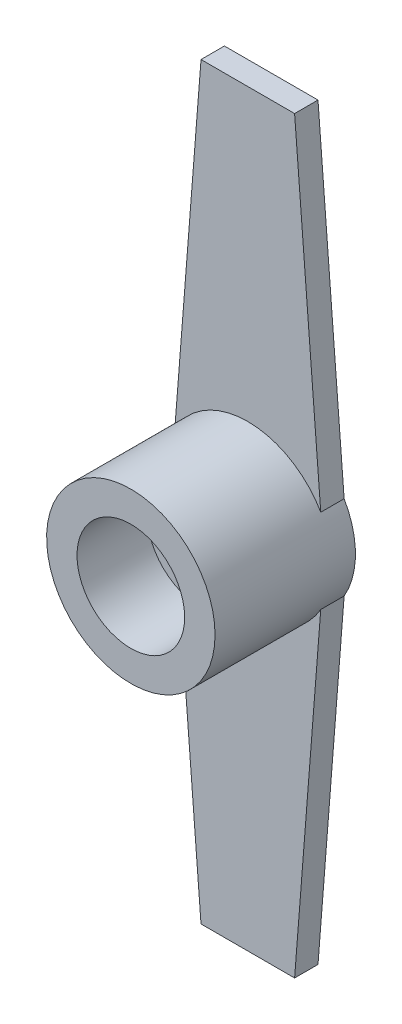
ISO-10303-21;
HEADER;
FILE_DESCRIPTION(('STEP AP214'),'2;1');
FILE_NAME('part.step','',(''),(''),'','','');
FILE_SCHEMA(('AUTOMOTIVE_DESIGN { 1 0 10303 214 1 1 1 1 }'));
ENDSEC;
DATA;
#1=APPLICATION_CONTEXT('core data for automotive mechanical design processes');
#2=APPLICATION_PROTOCOL_DEFINITION('international standard','automotive_design',2000,#1);
#3=PRODUCT_CONTEXT('',#1,'mechanical');
#4=PRODUCT('Part','Part','',(#3));
#5=PRODUCT_RELATED_PRODUCT_CATEGORY('part','',(#4));
#6=PRODUCT_DEFINITION_FORMATION('','',#4);
#7=PRODUCT_DEFINITION_CONTEXT('part definition',#1,'design');
#8=PRODUCT_DEFINITION('design','',#6,#7);
#9=PRODUCT_DEFINITION_SHAPE('','',#8);
#10=(LENGTH_UNIT() NAMED_UNIT(*) SI_UNIT(.MILLI.,.METRE.));
#11=(NAMED_UNIT(*) PLANE_ANGLE_UNIT() SI_UNIT($,.RADIAN.));
#12=(NAMED_UNIT(*) SI_UNIT($,.STERADIAN.) SOLID_ANGLE_UNIT());
#13=UNCERTAINTY_MEASURE_WITH_UNIT(LENGTH_MEASURE(1.E-05),#10,'distance_accuracy_value','');
#14=(GEOMETRIC_REPRESENTATION_CONTEXT(3) GLOBAL_UNCERTAINTY_ASSIGNED_CONTEXT((#13)) GLOBAL_UNIT_ASSIGNED_CONTEXT((#10,
#11,#12)) REPRESENTATION_CONTEXT('',''));
#15=CARTESIAN_POINT('',(0.,0.,0.));
#16=DIRECTION('',(0.,0.,1.));
#17=DIRECTION('',(1.,0.,0.));
#18=AXIS2_PLACEMENT_3D('',#15,#16,#17);
#19=CARTESIAN_POINT('',(-1.59594559789866E-13,0.,1.));
#20=DIRECTION('',(0.,0.,1.));
#21=DIRECTION('',(1.,0.,0.));
#22=AXIS2_PLACEMENT_3D('',#19,#20,#21);
#23=PLANE('',#22);
#24=CARTESIAN_POINT('',(0.,0.,1.));
#25=DIRECTION('',(0.,0.,1.));
#26=DIRECTION('',(1.,0.,0.));
#27=AXIS2_PLACEMENT_3D('',#24,#25,#26);
#28=CIRCLE('',#27,3.59999999999998);
#29=CARTESIAN_POINT('',(3.11769145362396,1.79999999999999,1.));
#30=VERTEX_POINT('',#29);
#31=CARTESIAN_POINT('',(-3.117691453624,1.80000000000001,1.));
#32=VERTEX_POINT('',#31);
#33=EDGE_CURVE('E49',#30,#32,#28,.T.);
#34=ORIENTED_EDGE('',*,*,#33,.F.);
#35=DIRECTION('',(-0.0784679720450922,0.996916635112049,0.));
#36=VECTOR('',#35,1.);
#37=CARTESIAN_POINT('',(3.11769145362398,1.8,1.));
#38=LINE('',#37,#36);
#39=CARTESIAN_POINT('',(2.,16.,1.));
#40=VERTEX_POINT('',#39);
#41=EDGE_CURVE('E177',#30,#40,#38,.T.);
#42=ORIENTED_EDGE('',*,*,#41,.T.);
#43=DIRECTION('',(-1.,0.,0.));
#44=VECTOR('',#43,1.);
#45=CARTESIAN_POINT('',(-2.,16.,1.));
#46=LINE('',#45,#44);
#47=CARTESIAN_POINT('',(-2.,16.,1.));
#48=VERTEX_POINT('',#47);
#49=EDGE_CURVE('E130',#40,#48,#46,.T.);
#50=ORIENTED_EDGE('',*,*,#49,.T.);
#51=DIRECTION('',(-0.0784679720450919,-0.996916635112049,0.));
#52=VECTOR('',#51,1.);
#53=CARTESIAN_POINT('',(-3.11769145362398,1.8,1.));
#54=LINE('',#53,#52);
#55=EDGE_CURVE('E126',#48,#32,#54,.T.);
#56=ORIENTED_EDGE('',*,*,#55,.T.);
#57=EDGE_LOOP('',(#34,#42,#50,#56));
#58=FACE_BOUND('',#57,.T.);
#59=ADVANCED_FACE('F38',(#58),#23,.T.);
#60=CARTESIAN_POINT('',(3.11769145362398,-1.8,1.));
#61=DIRECTION('',(-0.996916635112049,0.0784679720450922,0.));
#62=DIRECTION('',(-0.0784679720450922,-0.996916635112049,0.));
#63=AXIS2_PLACEMENT_3D('',#60,#61,#62);
#64=PLANE('',#63);
#65=DIRECTION('',(0.0784679720450922,0.996916635112049,0.));
#66=VECTOR('',#65,1.);
#67=CARTESIAN_POINT('',(3.11769145362398,-1.8,0.));
#68=LINE('',#67,#66);
#69=CARTESIAN_POINT('',(2.,-16.,0.));
#70=VERTEX_POINT('',#69);
#71=CARTESIAN_POINT('',(3.11769145362396,-1.79999999999999,0.));
#72=VERTEX_POINT('',#71);
#73=EDGE_CURVE('E134',#70,#72,#68,.T.);
#74=ORIENTED_EDGE('',*,*,#73,.T.);
#75=DIRECTION('',(0.,0.,-1.));
#76=VECTOR('',#75,1.);
#77=CARTESIAN_POINT('',(3.11769145362396,-1.79999999999999,1.));
#78=LINE('',#77,#76);
#79=CARTESIAN_POINT('',(3.11769145362396,-1.79999999999999,1.));
#80=VERTEX_POINT('',#79);
#81=EDGE_CURVE('E42',#80,#72,#78,.T.);
#82=ORIENTED_EDGE('',*,*,#81,.F.);
#83=DIRECTION('',(0.0784679720450922,0.996916635112049,0.));
#84=VECTOR('',#83,1.);
#85=CARTESIAN_POINT('',(3.11769145362398,-1.8,1.));
#86=LINE('',#85,#84);
#87=CARTESIAN_POINT('',(2.,-16.,1.));
#88=VERTEX_POINT('',#87);
#89=EDGE_CURVE('E99',#88,#80,#86,.T.);
#90=ORIENTED_EDGE('',*,*,#89,.F.);
#91=DIRECTION('',(0.,0.,-1.));
#92=VECTOR('',#91,1.);
#93=CARTESIAN_POINT('',(2.,-16.,1.));
#94=LINE('',#93,#92);
#95=EDGE_CURVE('E128',#88,#70,#94,.T.);
#96=ORIENTED_EDGE('',*,*,#95,.T.);
#97=EDGE_LOOP('',(#74,#82,#90,#96));
#98=FACE_BOUND('',#97,.T.);
#99=ADVANCED_FACE('F40',(#98),#64,.F.);
#100=CARTESIAN_POINT('',(3.11769145362398,1.8,1.));
#101=DIRECTION('',(-0.996916635112049,-0.0784679720450922,0.));
#102=DIRECTION('',(0.0784679720450922,-0.996916635112049,0.));
#103=AXIS2_PLACEMENT_3D('',#100,#101,#102);
#104=PLANE('',#103);
#105=DIRECTION('',(-0.0784679720450922,0.996916635112049,0.));
#106=VECTOR('',#105,1.);
#107=CARTESIAN_POINT('',(3.11769145362398,1.8,0.));
#108=LINE('',#107,#106);
#109=CARTESIAN_POINT('',(3.11769145362398,1.8,0.));
#110=VERTEX_POINT('',#109);
#111=CARTESIAN_POINT('',(2.,16.,0.));
#112=VERTEX_POINT('',#111);
#113=EDGE_CURVE('E140',#110,#112,#108,.T.);
#114=ORIENTED_EDGE('',*,*,#113,.T.);
#115=DIRECTION('',(0.,0.,-1.));
#116=VECTOR('',#115,1.);
#117=CARTESIAN_POINT('',(2.,16.,1.));
#118=LINE('',#117,#116);
#119=EDGE_CURVE('E155',#40,#112,#118,.T.);
#120=ORIENTED_EDGE('',*,*,#119,.F.);
#121=ORIENTED_EDGE('',*,*,#41,.F.);
#122=DIRECTION('',(0.,0.,-1.));
#123=VECTOR('',#122,1.);
#124=CARTESIAN_POINT('',(3.11769145362398,1.8,1.));
#125=LINE('',#124,#123);
#126=EDGE_CURVE('E157',#30,#110,#125,.T.);
#127=ORIENTED_EDGE('',*,*,#126,.T.);
#128=EDGE_LOOP('',(#114,#120,#121,#127));
#129=FACE_BOUND('',#128,.T.);
#130=ADVANCED_FACE('F170',(#129),#104,.F.);
#131=CARTESIAN_POINT('',(-2.,16.,1.));
#132=DIRECTION('',(0.,-1.,0.));
#133=DIRECTION('',(0.,0.,-1.));
#134=AXIS2_PLACEMENT_3D('',#131,#132,#133);
#135=PLANE('',#134);
#136=DIRECTION('',(-1.,0.,0.));
#137=VECTOR('',#136,1.);
#138=CARTESIAN_POINT('',(-2.,16.,0.));
#139=LINE('',#138,#137);
#140=CARTESIAN_POINT('',(-2.,16.,0.));
#141=VERTEX_POINT('',#140);
#142=EDGE_CURVE('E142',#112,#141,#139,.T.);
#143=ORIENTED_EDGE('',*,*,#142,.T.);
#144=DIRECTION('',(0.,0.,-1.));
#145=VECTOR('',#144,1.);
#146=CARTESIAN_POINT('',(-2.,16.,1.));
#147=LINE('',#146,#145);
#148=EDGE_CURVE('E152',#48,#141,#147,.T.);
#149=ORIENTED_EDGE('',*,*,#148,.F.);
#150=ORIENTED_EDGE('',*,*,#49,.F.);
#151=ORIENTED_EDGE('',*,*,#119,.T.);
#152=EDGE_LOOP('',(#143,#149,#150,#151));
#153=FACE_BOUND('',#152,.T.);
#154=ADVANCED_FACE('F173',(#153),#135,.F.);
#155=CARTESIAN_POINT('',(-3.11769145362398,1.8,1.));
#156=DIRECTION('',(0.996916635112049,-0.0784679720450919,0.));
#157=DIRECTION('',(0.0784679720450919,0.996916635112049,0.));
#158=AXIS2_PLACEMENT_3D('',#155,#156,#157);
#159=PLANE('',#158);
#160=DIRECTION('',(-0.0784679720450919,-0.996916635112049,0.));
#161=VECTOR('',#160,1.);
#162=CARTESIAN_POINT('',(-3.11769145362398,1.8,0.));
#163=LINE('',#162,#161);
#164=CARTESIAN_POINT('',(-3.117691453624,1.80000000000001,0.));
#165=VERTEX_POINT('',#164);
#166=EDGE_CURVE('E144',#141,#165,#163,.T.);
#167=ORIENTED_EDGE('',*,*,#166,.T.);
#168=DIRECTION('',(0.,0.,-1.));
#169=VECTOR('',#168,1.);
#170=CARTESIAN_POINT('',(-3.117691453624,1.80000000000001,1.));
#171=LINE('',#170,#169);
#172=EDGE_CURVE('E122',#32,#165,#171,.T.);
#173=ORIENTED_EDGE('',*,*,#172,.F.);
#174=ORIENTED_EDGE('',*,*,#55,.F.);
#175=ORIENTED_EDGE('',*,*,#148,.T.);
#176=EDGE_LOOP('',(#167,#173,#174,#175));
#177=FACE_BOUND('',#176,.T.);
#178=ADVANCED_FACE('F205',(#177),#159,.F.);
#179=CARTESIAN_POINT('',(-1.59594559789866E-13,0.,1.));
#180=DIRECTION('',(0.,0.,-1.));
#181=DIRECTION('',(-1.,0.,0.));
#182=AXIS2_PLACEMENT_3D('',#179,#180,#181);
#183=CYLINDRICAL_SURFACE('',#182,3.59999999999986);
#184=CARTESIAN_POINT('',(-1.59594559789866E-13,0.,0.));
#185=DIRECTION('',(0.,0.,1.));
#186=DIRECTION('',(1.,0.,0.));
#187=AXIS2_PLACEMENT_3D('',#184,#185,#186);
#188=CIRCLE('',#187,3.59999999999986);
#189=CARTESIAN_POINT('',(-3.11769145362398,-1.8,0.));
#190=VERTEX_POINT('',#189);
#191=EDGE_CURVE('E121',#165,#190,#188,.T.);
#192=ORIENTED_EDGE('',*,*,#191,.T.);
#193=DIRECTION('',(0.,0.,-1.));
#194=VECTOR('',#193,1.);
#195=CARTESIAN_POINT('',(-3.11769145362398,-1.8,1.));
#196=LINE('',#195,#194);
#197=CARTESIAN_POINT('',(-3.11769145362398,-1.8,1.));
#198=VERTEX_POINT('',#197);
#199=EDGE_CURVE('E116',#198,#190,#196,.T.);
#200=ORIENTED_EDGE('',*,*,#199,.F.);
#201=EDGE_CURVE('E11',#198,#80,#28,.T.);
#202=ORIENTED_EDGE('',*,*,#201,.T.);
#203=ORIENTED_EDGE('',*,*,#81,.T.);
#204=CARTESIAN_POINT('',(-1.59594559789866E-13,0.,0.));
#205=DIRECTION('',(0.,0.,1.));
#206=DIRECTION('',(-1.,0.,0.));
#207=AXIS2_PLACEMENT_3D('',#204,#205,#206);
#208=CIRCLE('',#207,3.60000000000014);
#209=EDGE_CURVE('E137',#72,#110,#208,.T.);
#210=ORIENTED_EDGE('',*,*,#209,.T.);
#211=ORIENTED_EDGE('',*,*,#126,.F.);
#212=ORIENTED_EDGE('',*,*,#33,.T.);
#213=ORIENTED_EDGE('',*,*,#172,.T.);
#214=EDGE_LOOP('',(#192,#200,#202,#203,#210,#211,#212,#213));
#215=FACE_BOUND('',#214,.T.);
#216=CARTESIAN_POINT('',(0.,0.,6.));
#217=DIRECTION('',(0.,0.,1.));
#218=DIRECTION('',(1.,0.,0.));
#219=AXIS2_PLACEMENT_3D('',#216,#217,#218);
#220=CIRCLE('',#219,3.59999999999998);
#221=CARTESIAN_POINT('',(3.59999999999998,0.,6.));
#222=VERTEX_POINT('',#221);
#223=EDGE_CURVE('E138',#222,#222,#220,.T.);
#224=ORIENTED_EDGE('',*,*,#223,.F.);
#225=EDGE_LOOP('',(#224));
#226=FACE_BOUND('',#225,.T.);
#227=ADVANCED_FACE('F117',(#215,#226),#183,.T.);
#228=CARTESIAN_POINT('',(-3.11769145362398,-1.8,1.));
#229=DIRECTION('',(0.996916635112049,0.0784679720450924,0.));
#230=DIRECTION('',(-0.0784679720450924,0.996916635112049,0.));
#231=AXIS2_PLACEMENT_3D('',#228,#229,#230);
#232=PLANE('',#231);
#233=DIRECTION('',(0.0784679720450924,-0.996916635112049,0.));
#234=VECTOR('',#233,1.);
#235=CARTESIAN_POINT('',(-3.11769145362398,-1.8,0.));
#236=LINE('',#235,#234);
#237=CARTESIAN_POINT('',(-2.,-16.,0.));
#238=VERTEX_POINT('',#237);
#239=EDGE_CURVE('E87',#190,#238,#236,.T.);
#240=ORIENTED_EDGE('',*,*,#239,.T.);
#241=DIRECTION('',(0.,0.,-1.));
#242=VECTOR('',#241,1.);
#243=CARTESIAN_POINT('',(-2.,-16.,1.));
#244=LINE('',#243,#242);
#245=CARTESIAN_POINT('',(-2.,-16.,1.));
#246=VERTEX_POINT('',#245);
#247=EDGE_CURVE('E123',#246,#238,#244,.T.);
#248=ORIENTED_EDGE('',*,*,#247,.F.);
#249=DIRECTION('',(0.0784679720450924,-0.996916635112049,0.));
#250=VECTOR('',#249,1.);
#251=CARTESIAN_POINT('',(-3.11769145362398,-1.8,1.));
#252=LINE('',#251,#250);
#253=EDGE_CURVE('E113',#198,#246,#252,.T.);
#254=ORIENTED_EDGE('',*,*,#253,.F.);
#255=ORIENTED_EDGE('',*,*,#199,.T.);
#256=EDGE_LOOP('',(#240,#248,#254,#255));
#257=FACE_BOUND('',#256,.T.);
#258=ADVANCED_FACE('F125',(#257),#232,.F.);
#259=CARTESIAN_POINT('',(-2.,-16.,1.));
#260=DIRECTION('',(0.,1.,0.));
#261=DIRECTION('',(0.,0.,1.));
#262=AXIS2_PLACEMENT_3D('',#259,#260,#261);
#263=PLANE('',#262);
#264=DIRECTION('',(1.,0.,0.));
#265=VECTOR('',#264,1.);
#266=CARTESIAN_POINT('',(-2.,-16.,0.));
#267=LINE('',#266,#265);
#268=EDGE_CURVE('E93',#238,#70,#267,.T.);
#269=ORIENTED_EDGE('',*,*,#268,.T.);
#270=ORIENTED_EDGE('',*,*,#95,.F.);
#271=DIRECTION('',(1.,0.,0.));
#272=VECTOR('',#271,1.);
#273=CARTESIAN_POINT('',(-2.,-16.,1.));
#274=LINE('',#273,#272);
#275=EDGE_CURVE('E57',#246,#88,#274,.T.);
#276=ORIENTED_EDGE('',*,*,#275,.F.);
#277=ORIENTED_EDGE('',*,*,#247,.T.);
#278=EDGE_LOOP('',(#269,#270,#276,#277));
#279=FACE_BOUND('',#278,.T.);
#280=ADVANCED_FACE('F211',(#279),#263,.F.);
#281=ORIENTED_EDGE('',*,*,#201,.F.);
#282=ORIENTED_EDGE('',*,*,#253,.T.);
#283=ORIENTED_EDGE('',*,*,#275,.T.);
#284=ORIENTED_EDGE('',*,*,#89,.T.);
#285=EDGE_LOOP('',(#281,#282,#283,#284));
#286=FACE_BOUND('',#285,.T.);
#287=ADVANCED_FACE('F111',(#286),#23,.T.);
#288=CARTESIAN_POINT('',(-1.59594559789866E-13,0.,0.));
#289=DIRECTION('',(0.,0.,1.));
#290=DIRECTION('',(1.,0.,0.));
#291=AXIS2_PLACEMENT_3D('',#288,#289,#290);
#292=PLANE('',#291);
#293=ORIENTED_EDGE('',*,*,#73,.F.);
#294=ORIENTED_EDGE('',*,*,#268,.F.);
#295=ORIENTED_EDGE('',*,*,#239,.F.);
#296=ORIENTED_EDGE('',*,*,#191,.F.);
#297=ORIENTED_EDGE('',*,*,#166,.F.);
#298=ORIENTED_EDGE('',*,*,#142,.F.);
#299=ORIENTED_EDGE('',*,*,#113,.F.);
#300=ORIENTED_EDGE('',*,*,#209,.F.);
#301=EDGE_LOOP('',(#293,#294,#295,#296,#297,#298,#299,#300));
#302=FACE_BOUND('',#301,.T.);
#303=ADVANCED_FACE('F166',(#302),#292,.F.);
#304=CARTESIAN_POINT('',(0.,0.,6.));
#305=DIRECTION('',(0.,0.,1.));
#306=DIRECTION('',(1.,0.,0.));
#307=AXIS2_PLACEMENT_3D('',#304,#305,#306);
#308=PLANE('',#307);
#309=CARTESIAN_POINT('',(0.,0.,6.));
#310=DIRECTION('',(0.,0.,1.));
#311=DIRECTION('',(1.,0.,0.));
#312=AXIS2_PLACEMENT_3D('',#309,#310,#311);
#313=CIRCLE('',#312,2.3);
#314=CARTESIAN_POINT('',(2.3,0.,6.));
#315=VERTEX_POINT('',#314);
#316=EDGE_CURVE('E185',#315,#315,#313,.T.);
#317=ORIENTED_EDGE('',*,*,#316,.F.);
#318=EDGE_LOOP('',(#317));
#319=FACE_BOUND('',#318,.T.);
#320=ORIENTED_EDGE('',*,*,#223,.T.);
#321=EDGE_LOOP('',(#320));
#322=FACE_BOUND('',#321,.T.);
#323=ADVANCED_FACE('F196',(#319,#322),#308,.T.);
#324=CARTESIAN_POINT('',(0.,0.,3.));
#325=DIRECTION('',(0.,0.,1.));
#326=DIRECTION('',(1.,0.,0.));
#327=AXIS2_PLACEMENT_3D('',#324,#325,#326);
#328=CYLINDRICAL_SURFACE('',#327,2.3);
#329=CARTESIAN_POINT('',(0.,0.,3.));
#330=DIRECTION('',(0.,0.,1.));
#331=DIRECTION('',(1.,0.,0.));
#332=AXIS2_PLACEMENT_3D('',#329,#330,#331);
#333=CIRCLE('',#332,2.3);
#334=CARTESIAN_POINT('',(2.3,0.,3.));
#335=VERTEX_POINT('',#334);
#336=EDGE_CURVE('E182',#335,#335,#333,.T.);
#337=ORIENTED_EDGE('',*,*,#336,.F.);
#338=EDGE_LOOP('',(#337));
#339=FACE_BOUND('',#338,.T.);
#340=ORIENTED_EDGE('',*,*,#316,.T.);
#341=EDGE_LOOP('',(#340));
#342=FACE_BOUND('',#341,.T.);
#343=ADVANCED_FACE('F193',(#339,#342),#328,.F.);
#344=CARTESIAN_POINT('',(0.,0.,3.));
#345=DIRECTION('',(0.,0.,1.));
#346=DIRECTION('',(1.,0.,0.));
#347=AXIS2_PLACEMENT_3D('',#344,#345,#346);
#348=PLANE('',#347);
#349=ORIENTED_EDGE('',*,*,#336,.T.);
#350=EDGE_LOOP('',(#349));
#351=FACE_BOUND('',#350,.T.);
#352=ADVANCED_FACE('F191',(#351),#348,.T.);
#353=CLOSED_SHELL('',(#59,#99,#130,#154,#178,#227,#258,#280,#287,#303,#323,#343,#352));
#354=MANIFOLD_SOLID_BREP('B2',#353);
#355=ADVANCED_BREP_SHAPE_REPRESENTATION('',(#18,#354),#14);
#356=SHAPE_DEFINITION_REPRESENTATION(#9,#355);
ENDSEC;
END-ISO-10303-21;
